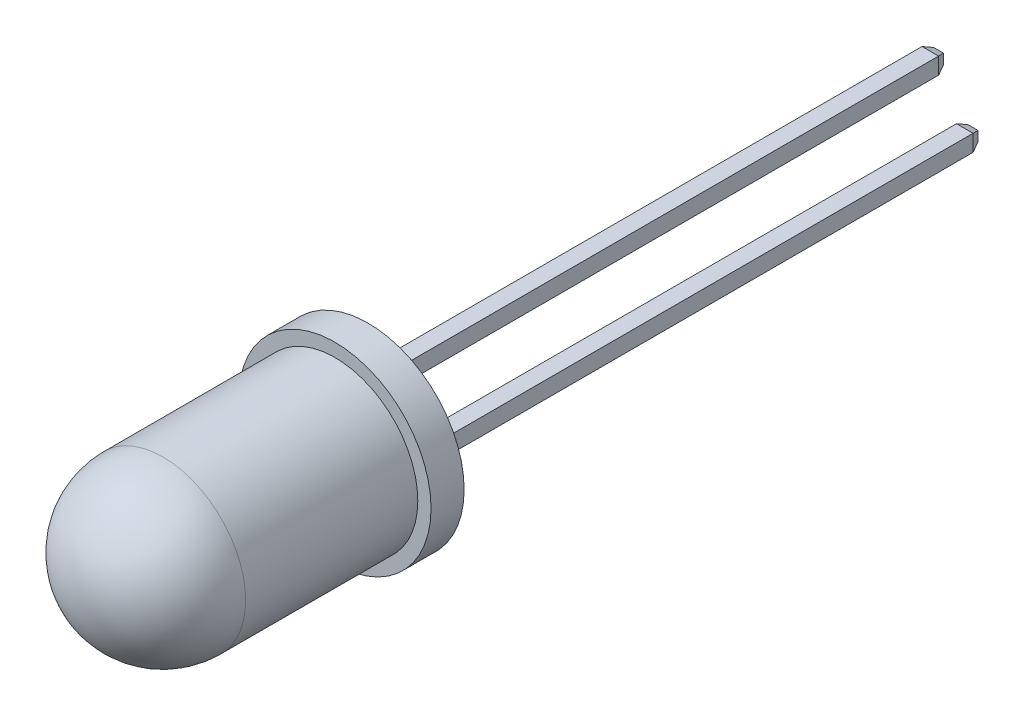
ISO-10303-21;
HEADER;
FILE_DESCRIPTION(('STEP AP214'),'2;1');
FILE_NAME('part.step','',(''),(''),'','','');
FILE_SCHEMA(('AUTOMOTIVE_DESIGN { 1 0 10303 214 1 1 1 1 }'));
ENDSEC;
DATA;
#1=APPLICATION_CONTEXT('core data for automotive mechanical design processes');
#2=APPLICATION_PROTOCOL_DEFINITION('international standard','automotive_design',2000,#1);
#3=PRODUCT_CONTEXT('',#1,'mechanical');
#4=PRODUCT('Part','Part','',(#3));
#5=PRODUCT_RELATED_PRODUCT_CATEGORY('part','',(#4));
#6=PRODUCT_DEFINITION_FORMATION('','',#4);
#7=PRODUCT_DEFINITION_CONTEXT('part definition',#1,'design');
#8=PRODUCT_DEFINITION('design','',#6,#7);
#9=PRODUCT_DEFINITION_SHAPE('','',#8);
#10=(LENGTH_UNIT() NAMED_UNIT(*) SI_UNIT(.MILLI.,.METRE.));
#11=(NAMED_UNIT(*) PLANE_ANGLE_UNIT() SI_UNIT($,.RADIAN.));
#12=(NAMED_UNIT(*) SI_UNIT($,.STERADIAN.) SOLID_ANGLE_UNIT());
#13=UNCERTAINTY_MEASURE_WITH_UNIT(LENGTH_MEASURE(1.E-05),#10,'distance_accuracy_value','');
#14=(GEOMETRIC_REPRESENTATION_CONTEXT(3) GLOBAL_UNCERTAINTY_ASSIGNED_CONTEXT((#13)) GLOBAL_UNIT_ASSIGNED_CONTEXT((#10,
#11,#12)) REPRESENTATION_CONTEXT('',''));
#15=CARTESIAN_POINT('',(0.,0.,0.));
#16=DIRECTION('',(0.,0.,1.));
#17=DIRECTION('',(1.,0.,0.));
#18=AXIS2_PLACEMENT_3D('',#15,#16,#17);
#19=CARTESIAN_POINT('',(0.,0.,0.));
#20=DIRECTION('',(0.,0.,1.));
#21=DIRECTION('',(1.,0.,0.));
#22=AXIS2_PLACEMENT_3D('',#19,#20,#21);
#23=SPHERICAL_SURFACE('',#22,2.5);
#24=CARTESIAN_POINT('',(0.,0.,0.));
#25=DIRECTION('',(0.,0.,-1.));
#26=DIRECTION('',(1.,0.,0.));
#27=AXIS2_PLACEMENT_3D('',#24,#25,#26);
#28=CIRCLE('',#27,2.5);
#29=CARTESIAN_POINT('',(-2.5,0.,0.));
#30=VERTEX_POINT('',#29);
#31=CARTESIAN_POINT('',(2.5,0.,0.));
#32=VERTEX_POINT('',#31);
#33=EDGE_CURVE('P0_E27',#30,#32,#28,.T.);
#34=ORIENTED_EDGE('',*,*,#33,.F.);
#35=CARTESIAN_POINT('',(0.,0.,0.));
#36=DIRECTION('',(0.,-1.,0.));
#37=DIRECTION('',(-1.,0.,0.));
#38=AXIS2_PLACEMENT_3D('',#35,#36,#37);
#39=CIRCLE('',#38,2.5);
#40=CARTESIAN_POINT('',(0.,0.,2.5));
#41=VERTEX_POINT('',#40);
#42=EDGE_CURVE('P0_E11',#41,#30,#39,.T.);
#43=ORIENTED_EDGE('',*,*,#42,.F.);
#44=ORIENTED_EDGE('',*,*,#42,.T.);
#45=CARTESIAN_POINT('',(0.,0.,0.));
#46=DIRECTION('',(0.,0.,-1.));
#47=DIRECTION('',(1.,0.,0.));
#48=AXIS2_PLACEMENT_3D('',#45,#46,#47);
#49=CIRCLE('',#48,2.5);
#50=EDGE_CURVE('P0_E71',#32,#30,#49,.T.);
#51=ORIENTED_EDGE('',*,*,#50,.F.);
#52=EDGE_LOOP('',(#34,#43,#44,#51));
#53=FACE_BOUND('',#52,.T.);
#54=ADVANCED_FACE('P0_F17',(#53),#23,.T.);
#55=CARTESIAN_POINT('',(0.,0.,-2.6));
#56=DIRECTION('',(0.,0.,-1.));
#57=DIRECTION('',(-1.,0.,0.));
#58=AXIS2_PLACEMENT_3D('',#55,#56,#57);
#59=CYLINDRICAL_SURFACE('',#58,2.5);
#60=CARTESIAN_POINT('',(0.,0.,-5.2));
#61=DIRECTION('',(0.,0.,-1.));
#62=DIRECTION('',(1.,0.,0.));
#63=AXIS2_PLACEMENT_3D('',#60,#61,#62);
#64=CIRCLE('',#63,2.5);
#65=CARTESIAN_POINT('',(2.5,0.,-5.2));
#66=VERTEX_POINT('',#65);
#67=EDGE_CURVE('P0_E68',#66,#66,#64,.T.);
#68=ORIENTED_EDGE('',*,*,#67,.F.);
#69=DIRECTION('',(0.,0.,1.));
#70=VECTOR('',#69,1.);
#71=CARTESIAN_POINT('',(2.5,0.,-2.6));
#72=LINE('',#71,#70);
#73=EDGE_CURVE('P0_E65',#66,#32,#72,.T.);
#74=ORIENTED_EDGE('',*,*,#73,.T.);
#75=ORIENTED_EDGE('',*,*,#50,.T.);
#76=ORIENTED_EDGE('',*,*,#33,.T.);
#77=ORIENTED_EDGE('',*,*,#73,.F.);
#78=EDGE_LOOP('',(#68,#74,#75,#76,#77));
#79=FACE_BOUND('',#78,.T.);
#80=ADVANCED_FACE('P0_F67',(#79),#59,.T.);
#81=CARTESIAN_POINT('',(-2.9,0.,-5.2));
#82=DIRECTION('',(0.,0.,1.));
#83=DIRECTION('',(1.,0.,0.));
#84=AXIS2_PLACEMENT_3D('',#81,#82,#83);
#85=PLANE('',#84);
#86=ORIENTED_EDGE('',*,*,#67,.T.);
#87=EDGE_LOOP('',(#86));
#88=FACE_BOUND('',#87,.T.);
#89=CARTESIAN_POINT('',(0.,0.,-5.2));
#90=DIRECTION('',(0.,0.,-1.));
#91=DIRECTION('',(1.,0.,0.));
#92=AXIS2_PLACEMENT_3D('',#89,#90,#91);
#93=CIRCLE('',#92,2.9);
#94=CARTESIAN_POINT('',(2.9,0.,-5.2));
#95=VERTEX_POINT('',#94);
#96=EDGE_CURVE('P0_E21',#95,#95,#93,.T.);
#97=ORIENTED_EDGE('',*,*,#96,.F.);
#98=EDGE_LOOP('',(#97));
#99=FACE_BOUND('',#98,.T.);
#100=ADVANCED_FACE('P0_F19',(#88,#99),#85,.T.);
#101=CARTESIAN_POINT('',(0.,0.,-5.7));
#102=DIRECTION('',(0.,0.,-1.));
#103=DIRECTION('',(-1.,0.,0.));
#104=AXIS2_PLACEMENT_3D('',#101,#102,#103);
#105=CYLINDRICAL_SURFACE('',#104,2.9);
#106=CARTESIAN_POINT('',(0.,0.,-6.2));
#107=DIRECTION('',(0.,0.,-1.));
#108=DIRECTION('',(1.,0.,0.));
#109=AXIS2_PLACEMENT_3D('',#106,#107,#108);
#110=CIRCLE('',#109,2.9);
#111=CARTESIAN_POINT('',(2.9,0.,-6.2));
#112=VERTEX_POINT('',#111);
#113=EDGE_CURVE('P0_E87',#112,#112,#110,.T.);
#114=ORIENTED_EDGE('',*,*,#113,.F.);
#115=DIRECTION('',(0.,0.,1.));
#116=VECTOR('',#115,1.);
#117=CARTESIAN_POINT('',(2.9,0.,-5.7));
#118=LINE('',#117,#116);
#119=EDGE_CURVE('P0_E80',#112,#95,#118,.T.);
#120=ORIENTED_EDGE('',*,*,#119,.T.);
#121=ORIENTED_EDGE('',*,*,#96,.T.);
#122=ORIENTED_EDGE('',*,*,#119,.F.);
#123=EDGE_LOOP('',(#114,#120,#121,#122));
#124=FACE_BOUND('',#123,.T.);
#125=ADVANCED_FACE('P0_F94',(#124),#105,.T.);
#126=CARTESIAN_POINT('',(0.,0.,-6.2));
#127=DIRECTION('',(0.,0.,-1.));
#128=DIRECTION('',(0.,-1.,0.));
#129=AXIS2_PLACEMENT_3D('',#126,#127,#128);
#130=PLANE('',#129);
#131=ORIENTED_EDGE('',*,*,#113,.T.);
#132=EDGE_LOOP('',(#131));
#133=FACE_BOUND('',#132,.T.);
#134=ADVANCED_FACE('P0_F93',(#133),#130,.T.);
#135=CLOSED_SHELL('',(#54,#80,#100,#125,#134));
#136=MANIFOLD_SOLID_BREP('P0_B1',#135);
#137=CARTESIAN_POINT('',(-1.02,-0.249999953433879,-6.2));
#138=DIRECTION('',(0.,-1.,0.));
#139=DIRECTION('',(0.,0.,-1.));
#140=AXIS2_PLACEMENT_3D('',#137,#138,#139);
#141=PLANE('',#140);
#142=DIRECTION('',(-1.,0.,0.));
#143=VECTOR('',#142,1.);
#144=CARTESIAN_POINT('',(-1.145,-0.249999953433879,-24.45));
#145=LINE('',#144,#143);
#146=CARTESIAN_POINT('',(-1.02,-0.249999953433879,-24.45));
#147=VERTEX_POINT('',#146);
#148=CARTESIAN_POINT('',(-1.52,-0.249999953433879,-24.45));
#149=VERTEX_POINT('',#148);
#150=EDGE_CURVE('P1_E246',#147,#149,#145,.T.);
#151=ORIENTED_EDGE('',*,*,#150,.F.);
#152=DIRECTION('',(0.,0.,-1.));
#153=VECTOR('',#152,1.);
#154=CARTESIAN_POINT('',(-1.02,-0.249999953433879,-6.2));
#155=LINE('',#154,#153);
#156=CARTESIAN_POINT('',(-1.02,-0.249999953433879,-6.2));
#157=VERTEX_POINT('',#156);
#158=EDGE_CURVE('P1_E41',#157,#147,#155,.T.);
#159=ORIENTED_EDGE('',*,*,#158,.F.);
#160=DIRECTION('',(0.00909052693064519,0.,0.999958680306403));
#161=VECTOR('',#160,1.);
#162=CARTESIAN_POINT('',(-1.00000001490116,-0.25,-4.00000005960464));
#163=LINE('',#162,#161);
#164=CARTESIAN_POINT('',(-1.00000001490116,-0.25,-4.00000005960464));
#165=VERTEX_POINT('',#164);
#166=EDGE_CURVE('P1_E151',#157,#165,#163,.T.);
#167=ORIENTED_EDGE('',*,*,#166,.T.);
#168=DIRECTION('',(1.,0.,0.));
#169=VECTOR('',#168,1.);
#170=CARTESIAN_POINT('',(-0.279064603238777,-0.25,-4.00000005960464));
#171=LINE('',#170,#169);
#172=CARTESIAN_POINT('',(-0.279064603238777,-0.25,-4.00000005960464));
#173=VERTEX_POINT('',#172);
#174=EDGE_CURVE('P1_E168',#165,#173,#171,.T.);
#175=ORIENTED_EDGE('',*,*,#174,.T.);
#176=DIRECTION('',(-0.523156160420928,0.,0.852236840211471));
#177=VECTOR('',#176,1.);
#178=CARTESIAN_POINT('',(-0.999999977648259,-0.25,-2.82557503708544));
#179=LINE('',#178,#177);
#180=CARTESIAN_POINT('',(-0.999999977648259,-0.25,-2.82557503708544));
#181=VERTEX_POINT('',#180);
#182=EDGE_CURVE('P1_E294',#173,#181,#179,.T.);
#183=ORIENTED_EDGE('',*,*,#182,.T.);
#184=DIRECTION('',(0.,0.,1.));
#185=VECTOR('',#184,1.);
#186=CARTESIAN_POINT('',(-0.999999977648258,-0.25,-2.35925807482562));
#187=LINE('',#186,#185);
#188=CARTESIAN_POINT('',(-0.999999977648258,-0.25,-2.35925807482562));
#189=VERTEX_POINT('',#188);
#190=EDGE_CURVE('P1_E179',#181,#189,#187,.T.);
#191=ORIENTED_EDGE('',*,*,#190,.T.);
#192=DIRECTION('',(-1.,0.,0.));
#193=VECTOR('',#192,1.);
#194=CARTESIAN_POINT('',(-1.76000001490117,-0.25,-2.35925807482562));
#195=LINE('',#194,#193);
#196=CARTESIAN_POINT('',(-1.76000001490117,-0.25,-2.35925807482562));
#197=VERTEX_POINT('',#196);
#198=EDGE_CURVE('P1_E200',#189,#197,#195,.T.);
#199=ORIENTED_EDGE('',*,*,#198,.T.);
#200=DIRECTION('',(0.,0.,-1.));
#201=VECTOR('',#200,1.);
#202=CARTESIAN_POINT('',(-1.76000001490116,-0.25,-4.00000005960465));
#203=LINE('',#202,#201);
#204=CARTESIAN_POINT('',(-1.76000001490116,-0.25,-4.00000005960465));
#205=VERTEX_POINT('',#204);
#206=EDGE_CURVE('P1_E208',#197,#205,#203,.T.);
#207=ORIENTED_EDGE('',*,*,#206,.T.);
#208=DIRECTION('',(-1.,0.,0.));
#209=VECTOR('',#208,1.);
#210=CARTESIAN_POINT('',(-2.00000002980232,-0.25,-4.00000005960464));
#211=LINE('',#210,#209);
#212=CARTESIAN_POINT('',(-2.00000002980232,-0.25,-4.00000005960464));
#213=VERTEX_POINT('',#212);
#214=EDGE_CURVE('P1_E257',#205,#213,#211,.T.);
#215=ORIENTED_EDGE('',*,*,#214,.T.);
#216=DIRECTION('',(0.,0.,-1.));
#217=VECTOR('',#216,1.);
#218=CARTESIAN_POINT('',(-2.00000002980232,-0.25,-5.00000007450581));
#219=LINE('',#218,#217);
#220=CARTESIAN_POINT('',(-2.00000002980232,-0.25,-5.00000007450581));
#221=VERTEX_POINT('',#220);
#222=EDGE_CURVE('P1_E225',#213,#221,#219,.T.);
#223=ORIENTED_EDGE('',*,*,#222,.T.);
#224=DIRECTION('',(1.,0.,0.));
#225=VECTOR('',#224,1.);
#226=CARTESIAN_POINT('',(-1.52,-0.25,-5.00000007450581));
#227=LINE('',#226,#225);
#228=CARTESIAN_POINT('',(-1.52,-0.25,-5.00000007450581));
#229=VERTEX_POINT('',#228);
#230=EDGE_CURVE('P1_E189',#221,#229,#227,.T.);
#231=ORIENTED_EDGE('',*,*,#230,.T.);
#232=DIRECTION('',(0.,0.,-1.));
#233=VECTOR('',#232,1.);
#234=CARTESIAN_POINT('',(-1.52,-0.25,-6.2));
#235=LINE('',#234,#233);
#236=EDGE_CURVE('P1_E11',#229,#149,#235,.T.);
#237=ORIENTED_EDGE('',*,*,#236,.T.);
#238=EDGE_LOOP('',(#151,#159,#167,#175,#183,#191,#199,#207,#215,#223,#231,#237));
#239=FACE_BOUND('',#238,.T.);
#240=ADVANCED_FACE('P1_F17',(#239),#141,.T.);
#241=CARTESIAN_POINT('',(-1.52,-0.249999953433879,-6.2));
#242=DIRECTION('',(-1.,0.,0.));
#243=DIRECTION('',(0.,0.,1.));
#244=AXIS2_PLACEMENT_3D('',#241,#242,#243);
#245=PLANE('',#244);
#246=DIRECTION('',(0.,1.,0.));
#247=VECTOR('',#246,1.);
#248=CARTESIAN_POINT('',(-1.52,-0.124999976716939,-24.45));
#249=LINE('',#248,#247);
#250=CARTESIAN_POINT('',(-1.52,0.249999953433879,-24.45));
#251=VERTEX_POINT('',#250);
#252=EDGE_CURVE('P1_E194',#149,#251,#249,.T.);
#253=ORIENTED_EDGE('',*,*,#252,.F.);
#254=ORIENTED_EDGE('',*,*,#236,.F.);
#255=DIRECTION('',(0.,1.,0.));
#256=VECTOR('',#255,1.);
#257=CARTESIAN_POINT('',(-1.52,0.,-5.00000007450581));
#258=LINE('',#257,#256);
#259=CARTESIAN_POINT('',(-1.52,0.25,-5.00000007450581));
#260=VERTEX_POINT('',#259);
#261=EDGE_CURVE('P1_E185',#229,#260,#258,.T.);
#262=ORIENTED_EDGE('',*,*,#261,.T.);
#263=DIRECTION('',(0.,0.,1.));
#264=VECTOR('',#263,1.);
#265=CARTESIAN_POINT('',(-1.52,0.25,-6.2));
#266=LINE('',#265,#264);
#267=EDGE_CURVE('P1_E28',#251,#260,#266,.T.);
#268=ORIENTED_EDGE('',*,*,#267,.F.);
#269=EDGE_LOOP('',(#253,#254,#262,#268));
#270=FACE_BOUND('',#269,.T.);
#271=ADVANCED_FACE('P1_F441',(#270),#245,.T.);
#272=CARTESIAN_POINT('',(-1.27,0.,-24.7));
#273=DIRECTION('',(0.,0.,-1.));
#274=DIRECTION('',(0.,-1.,0.));
#275=AXIS2_PLACEMENT_3D('',#272,#273,#274);
#276=PLANE('',#275);
#277=DIRECTION('',(-1.,0.,0.));
#278=VECTOR('',#277,1.);
#279=CARTESIAN_POINT('',(-1.395,0.149999953433879,-24.7));
#280=LINE('',#279,#278);
#281=CARTESIAN_POINT('',(-1.12,0.149999953433879,-24.7));
#282=VERTEX_POINT('',#281);
#283=CARTESIAN_POINT('',(-1.42,0.149999953433879,-24.7));
#284=VERTEX_POINT('',#283);
#285=EDGE_CURVE('P1_E193',#282,#284,#280,.T.);
#286=ORIENTED_EDGE('',*,*,#285,.F.);
#287=DIRECTION('',(0.,1.,0.));
#288=VECTOR('',#287,1.);
#289=CARTESIAN_POINT('',(-1.12,0.124999976716939,-24.7));
#290=LINE('',#289,#288);
#291=CARTESIAN_POINT('',(-1.12,-0.149999953433879,-24.7));
#292=VERTEX_POINT('',#291);
#293=EDGE_CURVE('P1_E218',#292,#282,#290,.T.);
#294=ORIENTED_EDGE('',*,*,#293,.F.);
#295=DIRECTION('',(1.,0.,0.));
#296=VECTOR('',#295,1.);
#297=CARTESIAN_POINT('',(-1.145,-0.149999953433879,-24.7));
#298=LINE('',#297,#296);
#299=CARTESIAN_POINT('',(-1.42,-0.149999953433879,-24.7));
#300=VERTEX_POINT('',#299);
#301=EDGE_CURVE('P1_E198',#300,#292,#298,.T.);
#302=ORIENTED_EDGE('',*,*,#301,.F.);
#303=DIRECTION('',(0.,-1.,0.));
#304=VECTOR('',#303,1.);
#305=CARTESIAN_POINT('',(-1.42,-0.124999976716939,-24.7));
#306=LINE('',#305,#304);
#307=EDGE_CURVE('P1_E236',#284,#300,#306,.T.);
#308=ORIENTED_EDGE('',*,*,#307,.F.);
#309=EDGE_LOOP('',(#286,#294,#302,#308));
#310=FACE_BOUND('',#309,.T.);
#311=ADVANCED_FACE('P1_F274',(#310),#276,.T.);
#312=CARTESIAN_POINT('',(-1.52,0.249999953433879,-6.2));
#313=DIRECTION('',(0.,1.,0.));
#314=DIRECTION('',(1.,0.,0.));
#315=AXIS2_PLACEMENT_3D('',#312,#313,#314);
#316=PLANE('',#315);
#317=DIRECTION('',(1.,0.,0.));
#318=VECTOR('',#317,1.);
#319=CARTESIAN_POINT('',(-1.395,0.249999953433879,-24.45));
#320=LINE('',#319,#318);
#321=CARTESIAN_POINT('',(-1.02,0.249999953433879,-24.45));
#322=VERTEX_POINT('',#321);
#323=EDGE_CURVE('P1_E245',#251,#322,#320,.T.);
#324=ORIENTED_EDGE('',*,*,#323,.F.);
#325=ORIENTED_EDGE('',*,*,#267,.T.);
#326=DIRECTION('',(-1.,0.,0.));
#327=VECTOR('',#326,1.);
#328=CARTESIAN_POINT('',(-1.52,0.25,-5.00000007450581));
#329=LINE('',#328,#327);
#330=CARTESIAN_POINT('',(-2.00000002980232,0.25,-5.00000007450581));
#331=VERTEX_POINT('',#330);
#332=EDGE_CURVE('P1_E190',#260,#331,#329,.T.);
#333=ORIENTED_EDGE('',*,*,#332,.T.);
#334=DIRECTION('',(0.,0.,1.));
#335=VECTOR('',#334,1.);
#336=CARTESIAN_POINT('',(-2.00000002980232,0.25,-5.00000007450581));
#337=LINE('',#336,#335);
#338=CARTESIAN_POINT('',(-2.00000002980232,0.25,-4.00000005960464));
#339=VERTEX_POINT('',#338);
#340=EDGE_CURVE('P1_E226',#331,#339,#337,.T.);
#341=ORIENTED_EDGE('',*,*,#340,.T.);
#342=DIRECTION('',(1.,0.,0.));
#343=VECTOR('',#342,1.);
#344=CARTESIAN_POINT('',(-2.00000002980232,0.25,-4.00000005960464));
#345=LINE('',#344,#343);
#346=CARTESIAN_POINT('',(-1.76000001490116,0.25,-4.00000005960465));
#347=VERTEX_POINT('',#346);
#348=EDGE_CURVE('P1_E21',#339,#347,#345,.T.);
#349=ORIENTED_EDGE('',*,*,#348,.T.);
#350=DIRECTION('',(0.,0.,1.));
#351=VECTOR('',#350,1.);
#352=CARTESIAN_POINT('',(-1.76000001490116,0.25,-4.00000005960465));
#353=LINE('',#352,#351);
#354=CARTESIAN_POINT('',(-1.76000001490117,0.25,-2.35925807482562));
#355=VERTEX_POINT('',#354);
#356=EDGE_CURVE('P1_E204',#347,#355,#353,.T.);
#357=ORIENTED_EDGE('',*,*,#356,.T.);
#358=DIRECTION('',(1.,0.,0.));
#359=VECTOR('',#358,1.);
#360=CARTESIAN_POINT('',(-1.76000001490117,0.25,-2.35925807482562));
#361=LINE('',#360,#359);
#362=CARTESIAN_POINT('',(-0.999999977648258,0.25,-2.35925807482562));
#363=VERTEX_POINT('',#362);
#364=EDGE_CURVE('P1_E183',#355,#363,#361,.T.);
#365=ORIENTED_EDGE('',*,*,#364,.T.);
#366=DIRECTION('',(0.,0.,-1.));
#367=VECTOR('',#366,1.);
#368=CARTESIAN_POINT('',(-0.999999977648258,0.25,-2.35925807482562));
#369=LINE('',#368,#367);
#370=CARTESIAN_POINT('',(-0.999999977648259,0.25,-2.82557503708544));
#371=VERTEX_POINT('',#370);
#372=EDGE_CURVE('P1_E298',#363,#371,#369,.T.);
#373=ORIENTED_EDGE('',*,*,#372,.T.);
#374=DIRECTION('',(0.523156160420928,0.,-0.852236840211471));
#375=VECTOR('',#374,1.);
#376=CARTESIAN_POINT('',(-0.999999977648259,0.25,-2.82557503708544));
#377=LINE('',#376,#375);
#378=CARTESIAN_POINT('',(-0.279064603238777,0.25,-4.00000005960464));
#379=VERTEX_POINT('',#378);
#380=EDGE_CURVE('P1_E158',#371,#379,#377,.T.);
#381=ORIENTED_EDGE('',*,*,#380,.T.);
#382=DIRECTION('',(-1.,0.,0.));
#383=VECTOR('',#382,1.);
#384=CARTESIAN_POINT('',(-0.279064603238777,0.25,-4.00000005960464));
#385=LINE('',#384,#383);
#386=CARTESIAN_POINT('',(-1.00000001490116,0.25,-4.00000005960464));
#387=VERTEX_POINT('',#386);
#388=EDGE_CURVE('P1_E154',#379,#387,#385,.T.);
#389=ORIENTED_EDGE('',*,*,#388,.T.);
#390=DIRECTION('',(-0.00909052693064519,0.,-0.999958680306403));
#391=VECTOR('',#390,1.);
#392=CARTESIAN_POINT('',(-1.00000001490116,0.25,-4.00000005960464));
#393=LINE('',#392,#391);
#394=CARTESIAN_POINT('',(-1.02,0.249999953433879,-6.2));
#395=VERTEX_POINT('',#394);
#396=EDGE_CURVE('P1_E142',#387,#395,#393,.T.);
#397=ORIENTED_EDGE('',*,*,#396,.T.);
#398=DIRECTION('',(0.,0.,-1.));
#399=VECTOR('',#398,1.);
#400=CARTESIAN_POINT('',(-1.02,0.249999953433879,-6.2));
#401=LINE('',#400,#399);
#402=EDGE_CURVE('P1_E215',#395,#322,#401,.T.);
#403=ORIENTED_EDGE('',*,*,#402,.T.);
#404=EDGE_LOOP('',(#324,#325,#333,#341,#349,#357,#365,#373,#381,#389,#397,#403));
#405=FACE_BOUND('',#404,.T.);
#406=ADVANCED_FACE('P1_F156',(#405),#316,.T.);
#407=CARTESIAN_POINT('',(-1.02,0.249999953433879,-6.2));
#408=DIRECTION('',(1.,0.,0.));
#409=DIRECTION('',(0.,1.,0.));
#410=AXIS2_PLACEMENT_3D('',#407,#408,#409);
#411=PLANE('',#410);
#412=DIRECTION('',(0.,-1.,0.));
#413=VECTOR('',#412,1.);
#414=CARTESIAN_POINT('',(-1.02,0.124999976716939,-24.45));
#415=LINE('',#414,#413);
#416=EDGE_CURVE('P1_E250',#322,#147,#415,.T.);
#417=ORIENTED_EDGE('',*,*,#416,.F.);
#418=ORIENTED_EDGE('',*,*,#402,.F.);
#419=DIRECTION('',(0.,1.,0.));
#420=VECTOR('',#419,1.);
#421=CARTESIAN_POINT('',(-1.02,0.124999976716939,-6.2));
#422=LINE('',#421,#420);
#423=EDGE_CURVE('P1_E148',#157,#395,#422,.T.);
#424=ORIENTED_EDGE('',*,*,#423,.F.);
#425=ORIENTED_EDGE('',*,*,#158,.T.);
#426=EDGE_LOOP('',(#417,#418,#424,#425));
#427=FACE_BOUND('',#426,.T.);
#428=ADVANCED_FACE('P1_F426',(#427),#411,.T.);
#429=CARTESIAN_POINT('',(-1.07,0.124999976716939,-24.575));
#430=DIRECTION('',(0.928476690885259,0.,-0.371390676354105));
#431=DIRECTION('',(0.,-1.,0.));
#432=AXIS2_PLACEMENT_3D('',#429,#430,#431);
#433=PLANE('',#432);
#434=ORIENTED_EDGE('',*,*,#416,.T.);
#435=DIRECTION('',(0.348155311911396,-0.348155311911397,0.870388279778489));
#436=VECTOR('',#435,1.);
#437=CARTESIAN_POINT('',(-1.12,-0.149999953433879,-24.7));
#438=LINE('',#437,#436);
#439=EDGE_CURVE('P1_E232',#292,#147,#438,.T.);
#440=ORIENTED_EDGE('',*,*,#439,.F.);
#441=ORIENTED_EDGE('',*,*,#293,.T.);
#442=DIRECTION('',(0.348155311911396,0.348155311911397,0.870388279778488));
#443=VECTOR('',#442,1.);
#444=CARTESIAN_POINT('',(-1.12,0.149999953433879,-24.7));
#445=LINE('',#444,#443);
#446=EDGE_CURVE('P1_E240',#282,#322,#445,.T.);
#447=ORIENTED_EDGE('',*,*,#446,.T.);
#448=EDGE_LOOP('',(#434,#440,#441,#447));
#449=FACE_BOUND('',#448,.T.);
#450=ADVANCED_FACE('P1_F264',(#449),#433,.T.);
#451=CARTESIAN_POINT('',(-1.145,-0.199999953433879,-24.575));
#452=DIRECTION('',(0.,-0.928476690885259,-0.371390676354105));
#453=DIRECTION('',(0.,0.371390676354105,-0.928476690885259));
#454=AXIS2_PLACEMENT_3D('',#451,#452,#453);
#455=PLANE('',#454);
#456=ORIENTED_EDGE('',*,*,#301,.T.);
#457=ORIENTED_EDGE('',*,*,#439,.T.);
#458=ORIENTED_EDGE('',*,*,#150,.T.);
#459=DIRECTION('',(-0.348155311911397,-0.348155311911397,0.870388279778488));
#460=VECTOR('',#459,1.);
#461=CARTESIAN_POINT('',(-1.42,-0.149999953433879,-24.7));
#462=LINE('',#461,#460);
#463=EDGE_CURVE('P1_E199',#300,#149,#462,.T.);
#464=ORIENTED_EDGE('',*,*,#463,.F.);
#465=EDGE_LOOP('',(#456,#457,#458,#464));
#466=FACE_BOUND('',#465,.T.);
#467=ADVANCED_FACE('P1_F425',(#466),#455,.T.);
#468=CARTESIAN_POINT('',(-1.47,-0.124999976716939,-24.575));
#469=DIRECTION('',(-0.928476690885259,0.,-0.371390676354105));
#470=DIRECTION('',(-0.371390676354105,0.,0.928476690885259));
#471=AXIS2_PLACEMENT_3D('',#468,#469,#470);
#472=PLANE('',#471);
#473=ORIENTED_EDGE('',*,*,#307,.T.);
#474=ORIENTED_EDGE('',*,*,#463,.T.);
#475=ORIENTED_EDGE('',*,*,#252,.T.);
#476=DIRECTION('',(-0.348155311911397,0.348155311911396,0.870388279778488));
#477=VECTOR('',#476,1.);
#478=CARTESIAN_POINT('',(-1.42,0.149999953433879,-24.7));
#479=LINE('',#478,#477);
#480=EDGE_CURVE('P1_E241',#284,#251,#479,.T.);
#481=ORIENTED_EDGE('',*,*,#480,.F.);
#482=EDGE_LOOP('',(#473,#474,#475,#481));
#483=FACE_BOUND('',#482,.T.);
#484=ADVANCED_FACE('P1_F19',(#483),#472,.T.);
#485=CARTESIAN_POINT('',(-1.395,0.199999953433879,-24.575));
#486=DIRECTION('',(0.,0.928476690885259,-0.371390676354105));
#487=DIRECTION('',(-1.,0.,0.));
#488=AXIS2_PLACEMENT_3D('',#485,#486,#487);
#489=PLANE('',#488);
#490=ORIENTED_EDGE('',*,*,#285,.T.);
#491=ORIENTED_EDGE('',*,*,#480,.T.);
#492=ORIENTED_EDGE('',*,*,#323,.T.);
#493=ORIENTED_EDGE('',*,*,#446,.F.);
#494=EDGE_LOOP('',(#490,#491,#492,#493));
#495=FACE_BOUND('',#494,.T.);
#496=ADVANCED_FACE('P1_F271',(#495),#489,.T.);
#497=CARTESIAN_POINT('',(-1.00000001490116,0.,-4.00000005960464));
#498=DIRECTION('',(0.999958680306403,0.,-0.00909052693064519));
#499=DIRECTION('',(0.,-1.,0.));
#500=AXIS2_PLACEMENT_3D('',#497,#498,#499);
#501=PLANE('',#500);
#502=ORIENTED_EDGE('',*,*,#423,.T.);
#503=ORIENTED_EDGE('',*,*,#396,.F.);
#504=DIRECTION('',(0.,-1.,0.));
#505=VECTOR('',#504,1.);
#506=CARTESIAN_POINT('',(-1.00000001490116,0.,-4.00000005960464));
#507=LINE('',#506,#505);
#508=EDGE_CURVE('P1_E147',#387,#165,#507,.T.);
#509=ORIENTED_EDGE('',*,*,#508,.T.);
#510=ORIENTED_EDGE('',*,*,#166,.F.);
#511=EDGE_LOOP('',(#502,#503,#509,#510));
#512=FACE_BOUND('',#511,.T.);
#513=ADVANCED_FACE('P1_F144',(#512),#501,.T.);
#514=CARTESIAN_POINT('',(-1.52,0.,-5.00000007450581));
#515=DIRECTION('',(0.,0.,-1.));
#516=DIRECTION('',(0.,-1.,0.));
#517=AXIS2_PLACEMENT_3D('',#514,#515,#516);
#518=PLANE('',#517);
#519=DIRECTION('',(0.,1.,0.));
#520=VECTOR('',#519,1.);
#521=CARTESIAN_POINT('',(-2.00000002980232,0.,-5.00000007450581));
#522=LINE('',#521,#520);
#523=EDGE_CURVE('P1_E221',#221,#331,#522,.T.);
#524=ORIENTED_EDGE('',*,*,#523,.T.);
#525=ORIENTED_EDGE('',*,*,#332,.F.);
#526=ORIENTED_EDGE('',*,*,#261,.F.);
#527=ORIENTED_EDGE('',*,*,#230,.F.);
#528=EDGE_LOOP('',(#524,#525,#526,#527));
#529=FACE_BOUND('',#528,.T.);
#530=ADVANCED_FACE('P1_F340',(#529),#518,.T.);
#531=CARTESIAN_POINT('',(-2.00000002980232,0.,-5.00000007450581));
#532=DIRECTION('',(-1.,0.,0.));
#533=DIRECTION('',(0.,1.,0.));
#534=AXIS2_PLACEMENT_3D('',#531,#532,#533);
#535=PLANE('',#534);
#536=DIRECTION('',(0.,1.,0.));
#537=VECTOR('',#536,1.);
#538=CARTESIAN_POINT('',(-2.00000002980232,0.,-4.00000005960464));
#539=LINE('',#538,#537);
#540=EDGE_CURVE('P1_E253',#213,#339,#539,.T.);
#541=ORIENTED_EDGE('',*,*,#540,.T.);
#542=ORIENTED_EDGE('',*,*,#340,.F.);
#543=ORIENTED_EDGE('',*,*,#523,.F.);
#544=ORIENTED_EDGE('',*,*,#222,.F.);
#545=EDGE_LOOP('',(#541,#542,#543,#544));
#546=FACE_BOUND('',#545,.T.);
#547=ADVANCED_FACE('P1_F325',(#546),#535,.T.);
#548=CARTESIAN_POINT('',(-2.00000002980232,0.,-4.00000005960464));
#549=DIRECTION('',(0.,0.,1.));
#550=DIRECTION('',(1.,0.,0.));
#551=AXIS2_PLACEMENT_3D('',#548,#549,#550);
#552=PLANE('',#551);
#553=DIRECTION('',(0.,1.,0.));
#554=VECTOR('',#553,1.);
#555=CARTESIAN_POINT('',(-1.76000001490116,0.,-4.00000005960465));
#556=LINE('',#555,#554);
#557=EDGE_CURVE('P1_E211',#205,#347,#556,.T.);
#558=ORIENTED_EDGE('',*,*,#557,.T.);
#559=ORIENTED_EDGE('',*,*,#348,.F.);
#560=ORIENTED_EDGE('',*,*,#540,.F.);
#561=ORIENTED_EDGE('',*,*,#214,.F.);
#562=EDGE_LOOP('',(#558,#559,#560,#561));
#563=FACE_BOUND('',#562,.T.);
#564=ADVANCED_FACE('P1_F327',(#563),#552,.T.);
#565=CARTESIAN_POINT('',(-1.76000001490116,0.,-4.00000005960465));
#566=DIRECTION('',(-1.,0.,0.));
#567=DIRECTION('',(0.,0.,1.));
#568=AXIS2_PLACEMENT_3D('',#565,#566,#567);
#569=PLANE('',#568);
#570=DIRECTION('',(0.,1.,0.));
#571=VECTOR('',#570,1.);
#572=CARTESIAN_POINT('',(-1.76000001490117,0.,-2.35925807482562));
#573=LINE('',#572,#571);
#574=EDGE_CURVE('P1_E205',#197,#355,#573,.T.);
#575=ORIENTED_EDGE('',*,*,#574,.T.);
#576=ORIENTED_EDGE('',*,*,#356,.F.);
#577=ORIENTED_EDGE('',*,*,#557,.F.);
#578=ORIENTED_EDGE('',*,*,#206,.F.);
#579=EDGE_LOOP('',(#575,#576,#577,#578));
#580=FACE_BOUND('',#579,.T.);
#581=ADVANCED_FACE('P1_F354',(#580),#569,.T.);
#582=CARTESIAN_POINT('',(-1.76000001490117,0.,-2.35925807482562));
#583=DIRECTION('',(0.,0.,1.));
#584=DIRECTION('',(1.,0.,0.));
#585=AXIS2_PLACEMENT_3D('',#582,#583,#584);
#586=PLANE('',#585);
#587=DIRECTION('',(0.,1.,0.));
#588=VECTOR('',#587,1.);
#589=CARTESIAN_POINT('',(-0.999999977648258,0.,-2.35925807482562));
#590=LINE('',#589,#588);
#591=EDGE_CURVE('P1_E184',#189,#363,#590,.T.);
#592=ORIENTED_EDGE('',*,*,#591,.T.);
#593=ORIENTED_EDGE('',*,*,#364,.F.);
#594=ORIENTED_EDGE('',*,*,#574,.F.);
#595=ORIENTED_EDGE('',*,*,#198,.F.);
#596=EDGE_LOOP('',(#592,#593,#594,#595));
#597=FACE_BOUND('',#596,.T.);
#598=ADVANCED_FACE('P1_F348',(#597),#586,.T.);
#599=CARTESIAN_POINT('',(-0.999999977648258,0.,-2.35925807482562));
#600=DIRECTION('',(1.,0.,0.));
#601=DIRECTION('',(0.,0.,-1.));
#602=AXIS2_PLACEMENT_3D('',#599,#600,#601);
#603=PLANE('',#602);
#604=DIRECTION('',(0.,1.,0.));
#605=VECTOR('',#604,1.);
#606=CARTESIAN_POINT('',(-0.999999977648259,0.,-2.82557503708544));
#607=LINE('',#606,#605);
#608=EDGE_CURVE('P1_E178',#181,#371,#607,.T.);
#609=ORIENTED_EDGE('',*,*,#608,.T.);
#610=ORIENTED_EDGE('',*,*,#372,.F.);
#611=ORIENTED_EDGE('',*,*,#591,.F.);
#612=ORIENTED_EDGE('',*,*,#190,.F.);
#613=EDGE_LOOP('',(#609,#610,#611,#612));
#614=FACE_BOUND('',#613,.T.);
#615=ADVANCED_FACE('P1_F353',(#614),#603,.T.);
#616=CARTESIAN_POINT('',(-0.999999977648259,0.,-2.82557503708544));
#617=DIRECTION('',(0.852236840211471,0.,0.523156160420928));
#618=DIRECTION('',(0.,-1.,0.));
#619=AXIS2_PLACEMENT_3D('',#616,#617,#618);
#620=PLANE('',#619);
#621=DIRECTION('',(0.,1.,0.));
#622=VECTOR('',#621,1.);
#623=CARTESIAN_POINT('',(-0.279064603238777,0.,-4.00000005960464));
#624=LINE('',#623,#622);
#625=EDGE_CURVE('P1_E163',#173,#379,#624,.T.);
#626=ORIENTED_EDGE('',*,*,#625,.T.);
#627=ORIENTED_EDGE('',*,*,#380,.F.);
#628=ORIENTED_EDGE('',*,*,#608,.F.);
#629=ORIENTED_EDGE('',*,*,#182,.F.);
#630=EDGE_LOOP('',(#626,#627,#628,#629));
#631=FACE_BOUND('',#630,.T.);
#632=ADVANCED_FACE('P1_F374',(#631),#620,.T.);
#633=CARTESIAN_POINT('',(-0.279064603238777,0.,-4.00000005960464));
#634=DIRECTION('',(0.,0.,-1.));
#635=DIRECTION('',(-1.,0.,0.));
#636=AXIS2_PLACEMENT_3D('',#633,#634,#635);
#637=PLANE('',#636);
#638=ORIENTED_EDGE('',*,*,#508,.F.);
#639=ORIENTED_EDGE('',*,*,#388,.F.);
#640=ORIENTED_EDGE('',*,*,#625,.F.);
#641=ORIENTED_EDGE('',*,*,#174,.F.);
#642=EDGE_LOOP('',(#638,#639,#640,#641));
#643=FACE_BOUND('',#642,.T.);
#644=ADVANCED_FACE('P1_F166',(#643),#637,.T.);
#645=CLOSED_SHELL('',(#240,#271,#311,#406,#428,#450,#467,#484,#496,#513,#530,#547,#564,#581,
#598,#615,#632,#644));
#646=MANIFOLD_SOLID_BREP('P1_B1',#645);
#647=CARTESIAN_POINT('',(1.02,0.249999953433879,-6.2));
#648=DIRECTION('',(0.,1.,0.));
#649=DIRECTION('',(1.,0.,0.));
#650=AXIS2_PLACEMENT_3D('',#647,#648,#649);
#651=PLANE('',#650);
#652=DIRECTION('',(1.,0.,0.));
#653=VECTOR('',#652,1.);
#654=CARTESIAN_POINT('',(1.145,0.249999953433879,-22.95));
#655=LINE('',#654,#653);
#656=CARTESIAN_POINT('',(1.02,0.249999953433879,-22.95));
#657=VERTEX_POINT('',#656);
#658=CARTESIAN_POINT('',(1.52,0.249999953433879,-22.95));
#659=VERTEX_POINT('',#658);
#660=EDGE_CURVE('P2_E184',#657,#659,#655,.T.);
#661=ORIENTED_EDGE('',*,*,#660,.F.);
#662=DIRECTION('',(0.,0.,-1.));
#663=VECTOR('',#662,1.);
#664=CARTESIAN_POINT('',(1.02,0.249999953433879,-6.2));
#665=LINE('',#664,#663);
#666=CARTESIAN_POINT('',(1.02,0.25,-4.00000005960464));
#667=VERTEX_POINT('',#666);
#668=EDGE_CURVE('P2_E42',#667,#657,#665,.T.);
#669=ORIENTED_EDGE('',*,*,#668,.F.);
#670=DIRECTION('',(-1.,0.,0.));
#671=VECTOR('',#670,1.);
#672=CARTESIAN_POINT('',(0.344751455826432,0.25,-4.00000005960464));
#673=LINE('',#672,#671);
#674=CARTESIAN_POINT('',(0.344751455826432,0.25,-4.00000005960464));
#675=VERTEX_POINT('',#674);
#676=EDGE_CURVE('P2_E138',#667,#675,#673,.T.);
#677=ORIENTED_EDGE('',*,*,#676,.T.);
#678=DIRECTION('',(-0.523156160420928,0.,0.852236840211471));
#679=VECTOR('',#678,1.);
#680=CARTESIAN_POINT('',(1.02,0.25,-5.09999988600612));
#681=LINE('',#680,#679);
#682=CARTESIAN_POINT('',(-0.399999991059304,0.25,-2.78677795145601));
#683=VERTEX_POINT('',#682);
#684=EDGE_CURVE('P2_E126',#675,#683,#681,.T.);
#685=ORIENTED_EDGE('',*,*,#684,.T.);
#686=DIRECTION('',(0.,0.,1.));
#687=VECTOR('',#686,1.);
#688=CARTESIAN_POINT('',(-0.399999991059304,0.25,-2.78677795145601));
#689=LINE('',#688,#687);
#690=CARTESIAN_POINT('',(-0.399999991059303,0.25,-2.35925807482562));
#691=VERTEX_POINT('',#690);
#692=EDGE_CURVE('P2_E154',#683,#691,#689,.T.);
#693=ORIENTED_EDGE('',*,*,#692,.T.);
#694=DIRECTION('',(1.,0.,0.));
#695=VECTOR('',#694,1.);
#696=CARTESIAN_POINT('',(-0.399999991059303,0.25,-2.35925807482562));
#697=LINE('',#696,#695);
#698=CARTESIAN_POINT('',(1.52,0.25,-2.35925807482562));
#699=VERTEX_POINT('',#698);
#700=EDGE_CURVE('P2_E149',#691,#699,#697,.T.);
#701=ORIENTED_EDGE('',*,*,#700,.T.);
#702=DIRECTION('',(0.,0.,-1.));
#703=VECTOR('',#702,1.);
#704=CARTESIAN_POINT('',(1.52,0.25,-2.35925807482562));
#705=LINE('',#704,#703);
#706=EDGE_CURVE('P2_E11',#699,#659,#705,.T.);
#707=ORIENTED_EDGE('',*,*,#706,.T.);
#708=EDGE_LOOP('',(#661,#669,#677,#685,#693,#701,#707));
#709=FACE_BOUND('',#708,.T.);
#710=ADVANCED_FACE('P2_F17',(#709),#651,.T.);
#711=CARTESIAN_POINT('',(1.52,0.249999953433879,-6.2));
#712=DIRECTION('',(1.,0.,0.));
#713=DIRECTION('',(0.,1.,0.));
#714=AXIS2_PLACEMENT_3D('',#711,#712,#713);
#715=PLANE('',#714);
#716=DIRECTION('',(0.,-1.,0.));
#717=VECTOR('',#716,1.);
#718=CARTESIAN_POINT('',(1.52,0.124999976716939,-22.95));
#719=LINE('',#718,#717);
#720=CARTESIAN_POINT('',(1.52,-0.249999953433879,-22.95));
#721=VERTEX_POINT('',#720);
#722=EDGE_CURVE('P2_E191',#659,#721,#719,.T.);
#723=ORIENTED_EDGE('',*,*,#722,.F.);
#724=ORIENTED_EDGE('',*,*,#706,.F.);
#725=DIRECTION('',(0.,1.,0.));
#726=VECTOR('',#725,1.);
#727=CARTESIAN_POINT('',(1.52,0.,-2.35925807482562));
#728=LINE('',#727,#726);
#729=CARTESIAN_POINT('',(1.52,-0.25,-2.35925807482562));
#730=VERTEX_POINT('',#729);
#731=EDGE_CURVE('P2_E134',#730,#699,#728,.T.);
#732=ORIENTED_EDGE('',*,*,#731,.F.);
#733=DIRECTION('',(0.,0.,1.));
#734=VECTOR('',#733,1.);
#735=CARTESIAN_POINT('',(1.52,-0.25,-2.35925807482562));
#736=LINE('',#735,#734);
#737=EDGE_CURVE('P2_E28',#721,#730,#736,.T.);
#738=ORIENTED_EDGE('',*,*,#737,.F.);
#739=EDGE_LOOP('',(#723,#724,#732,#738));
#740=FACE_BOUND('',#739,.T.);
#741=ADVANCED_FACE('P2_F285',(#740),#715,.T.);
#742=CARTESIAN_POINT('',(1.27,0.,-23.2));
#743=DIRECTION('',(0.,0.,-1.));
#744=DIRECTION('',(0.,-1.,0.));
#745=AXIS2_PLACEMENT_3D('',#742,#743,#744);
#746=PLANE('',#745);
#747=DIRECTION('',(1.,0.,0.));
#748=VECTOR('',#747,1.);
#749=CARTESIAN_POINT('',(1.395,-0.149999953433879,-23.2));
#750=LINE('',#749,#748);
#751=CARTESIAN_POINT('',(1.12,-0.149999953433879,-23.2));
#752=VERTEX_POINT('',#751);
#753=CARTESIAN_POINT('',(1.42,-0.149999953433879,-23.2));
#754=VERTEX_POINT('',#753);
#755=EDGE_CURVE('P2_E125',#752,#754,#750,.T.);
#756=ORIENTED_EDGE('',*,*,#755,.F.);
#757=DIRECTION('',(0.,-1.,0.));
#758=VECTOR('',#757,1.);
#759=CARTESIAN_POINT('',(1.12,-0.124999976716939,-23.2));
#760=LINE('',#759,#758);
#761=CARTESIAN_POINT('',(1.12,0.149999953433879,-23.2));
#762=VERTEX_POINT('',#761);
#763=EDGE_CURVE('P2_E174',#762,#752,#760,.T.);
#764=ORIENTED_EDGE('',*,*,#763,.F.);
#765=DIRECTION('',(-1.,0.,0.));
#766=VECTOR('',#765,1.);
#767=CARTESIAN_POINT('',(1.145,0.149999953433879,-23.2));
#768=LINE('',#767,#766);
#769=CARTESIAN_POINT('',(1.42,0.149999953433879,-23.2));
#770=VERTEX_POINT('',#769);
#771=EDGE_CURVE('P2_E185',#770,#762,#768,.T.);
#772=ORIENTED_EDGE('',*,*,#771,.F.);
#773=DIRECTION('',(0.,1.,0.));
#774=VECTOR('',#773,1.);
#775=CARTESIAN_POINT('',(1.42,0.124999976716939,-23.2));
#776=LINE('',#775,#774);
#777=EDGE_CURVE('P2_E21',#754,#770,#776,.T.);
#778=ORIENTED_EDGE('',*,*,#777,.F.);
#779=EDGE_LOOP('',(#756,#764,#772,#778));
#780=FACE_BOUND('',#779,.T.);
#781=ADVANCED_FACE('P2_F234',(#780),#746,.T.);
#782=CARTESIAN_POINT('',(1.52,-0.249999953433879,-6.2));
#783=DIRECTION('',(0.,-1.,0.));
#784=DIRECTION('',(0.,0.,-1.));
#785=AXIS2_PLACEMENT_3D('',#782,#783,#784);
#786=PLANE('',#785);
#787=DIRECTION('',(-1.,0.,0.));
#788=VECTOR('',#787,1.);
#789=CARTESIAN_POINT('',(1.395,-0.249999953433879,-22.95));
#790=LINE('',#789,#788);
#791=CARTESIAN_POINT('',(1.02,-0.249999953433879,-22.95));
#792=VERTEX_POINT('',#791);
#793=EDGE_CURVE('P2_E160',#721,#792,#790,.T.);
#794=ORIENTED_EDGE('',*,*,#793,.F.);
#795=ORIENTED_EDGE('',*,*,#737,.T.);
#796=DIRECTION('',(-1.,0.,0.));
#797=VECTOR('',#796,1.);
#798=CARTESIAN_POINT('',(-0.399999991059303,-0.25,-2.35925807482562));
#799=LINE('',#798,#797);
#800=CARTESIAN_POINT('',(-0.399999991059303,-0.25,-2.35925807482562));
#801=VERTEX_POINT('',#800);
#802=EDGE_CURVE('P2_E148',#730,#801,#799,.T.);
#803=ORIENTED_EDGE('',*,*,#802,.T.);
#804=DIRECTION('',(0.,0.,-1.));
#805=VECTOR('',#804,1.);
#806=CARTESIAN_POINT('',(-0.399999991059304,-0.25,-2.78677795145601));
#807=LINE('',#806,#805);
#808=CARTESIAN_POINT('',(-0.399999991059304,-0.25,-2.78677795145601));
#809=VERTEX_POINT('',#808);
#810=EDGE_CURVE('P2_E119',#801,#809,#807,.T.);
#811=ORIENTED_EDGE('',*,*,#810,.T.);
#812=DIRECTION('',(0.523156160420928,0.,-0.852236840211471));
#813=VECTOR('',#812,1.);
#814=CARTESIAN_POINT('',(1.02,-0.25,-5.09999988600612));
#815=LINE('',#814,#813);
#816=CARTESIAN_POINT('',(0.344751455826432,-0.25,-4.00000005960464));
#817=VERTEX_POINT('',#816);
#818=EDGE_CURVE('P2_E114',#809,#817,#815,.T.);
#819=ORIENTED_EDGE('',*,*,#818,.T.);
#820=DIRECTION('',(1.,0.,0.));
#821=VECTOR('',#820,1.);
#822=CARTESIAN_POINT('',(0.344751455826432,-0.25,-4.00000005960464));
#823=LINE('',#822,#821);
#824=CARTESIAN_POINT('',(1.02,-0.25,-4.00000005960464));
#825=VERTEX_POINT('',#824);
#826=EDGE_CURVE('P2_E117',#817,#825,#823,.T.);
#827=ORIENTED_EDGE('',*,*,#826,.T.);
#828=DIRECTION('',(0.,0.,-1.));
#829=VECTOR('',#828,1.);
#830=CARTESIAN_POINT('',(1.02,-0.25,-6.2));
#831=LINE('',#830,#829);
#832=EDGE_CURVE('P2_E86',#825,#792,#831,.T.);
#833=ORIENTED_EDGE('',*,*,#832,.T.);
#834=EDGE_LOOP('',(#794,#795,#803,#811,#819,#827,#833));
#835=FACE_BOUND('',#834,.T.);
#836=ADVANCED_FACE('P2_F116',(#835),#786,.T.);
#837=CARTESIAN_POINT('',(1.02,-0.249999953433879,-6.2));
#838=DIRECTION('',(-1.,0.,0.));
#839=DIRECTION('',(0.,0.,1.));
#840=AXIS2_PLACEMENT_3D('',#837,#838,#839);
#841=PLANE('',#840);
#842=DIRECTION('',(0.,1.,0.));
#843=VECTOR('',#842,1.);
#844=CARTESIAN_POINT('',(1.02,-0.124999976716939,-22.95));
#845=LINE('',#844,#843);
#846=EDGE_CURVE('P2_E177',#792,#657,#845,.T.);
#847=ORIENTED_EDGE('',*,*,#846,.F.);
#848=ORIENTED_EDGE('',*,*,#832,.F.);
#849=DIRECTION('',(0.,1.,0.));
#850=VECTOR('',#849,1.);
#851=CARTESIAN_POINT('',(1.02,0.,-4.00000005960464));
#852=LINE('',#851,#850);
#853=EDGE_CURVE('P2_E132',#825,#667,#852,.T.);
#854=ORIENTED_EDGE('',*,*,#853,.T.);
#855=ORIENTED_EDGE('',*,*,#668,.T.);
#856=EDGE_LOOP('',(#847,#848,#854,#855));
#857=FACE_BOUND('',#856,.T.);
#858=ADVANCED_FACE('P2_F217',(#857),#841,.T.);
#859=CARTESIAN_POINT('',(1.07,-0.124999976716939,-23.075));
#860=DIRECTION('',(-0.928476690885259,0.,-0.371390676354105));
#861=DIRECTION('',(-0.371390676354105,0.,0.928476690885259));
#862=AXIS2_PLACEMENT_3D('',#859,#860,#861);
#863=PLANE('',#862);
#864=ORIENTED_EDGE('',*,*,#846,.T.);
#865=DIRECTION('',(-0.348155311911396,0.348155311911397,0.870388279778489));
#866=VECTOR('',#865,1.);
#867=CARTESIAN_POINT('',(1.12,0.149999953433879,-23.2));
#868=LINE('',#867,#866);
#869=EDGE_CURVE('P2_E180',#762,#657,#868,.T.);
#870=ORIENTED_EDGE('',*,*,#869,.F.);
#871=ORIENTED_EDGE('',*,*,#763,.T.);
#872=DIRECTION('',(-0.348155311911396,-0.348155311911397,0.870388279778489));
#873=VECTOR('',#872,1.);
#874=CARTESIAN_POINT('',(1.12,-0.149999953433879,-23.2));
#875=LINE('',#874,#873);
#876=EDGE_CURVE('P2_E156',#752,#792,#875,.T.);
#877=ORIENTED_EDGE('',*,*,#876,.T.);
#878=EDGE_LOOP('',(#864,#870,#871,#877));
#879=FACE_BOUND('',#878,.T.);
#880=ADVANCED_FACE('P2_F222',(#879),#863,.T.);
#881=CARTESIAN_POINT('',(1.145,0.199999953433879,-23.075));
#882=DIRECTION('',(0.,0.928476690885259,-0.371390676354105));
#883=DIRECTION('',(-1.,0.,0.));
#884=AXIS2_PLACEMENT_3D('',#881,#882,#883);
#885=PLANE('',#884);
#886=ORIENTED_EDGE('',*,*,#771,.T.);
#887=ORIENTED_EDGE('',*,*,#869,.T.);
#888=ORIENTED_EDGE('',*,*,#660,.T.);
#889=DIRECTION('',(0.348155311911397,0.348155311911396,0.870388279778488));
#890=VECTOR('',#889,1.);
#891=CARTESIAN_POINT('',(1.42,0.149999953433879,-23.2));
#892=LINE('',#891,#890);
#893=EDGE_CURVE('P2_E203',#770,#659,#892,.T.);
#894=ORIENTED_EDGE('',*,*,#893,.F.);
#895=EDGE_LOOP('',(#886,#887,#888,#894));
#896=FACE_BOUND('',#895,.T.);
#897=ADVANCED_FACE('P2_F242',(#896),#885,.T.);
#898=CARTESIAN_POINT('',(1.47,0.124999976716939,-23.075));
#899=DIRECTION('',(0.928476690885259,0.,-0.371390676354105));
#900=DIRECTION('',(0.,-1.,0.));
#901=AXIS2_PLACEMENT_3D('',#898,#899,#900);
#902=PLANE('',#901);
#903=ORIENTED_EDGE('',*,*,#777,.T.);
#904=ORIENTED_EDGE('',*,*,#893,.T.);
#905=ORIENTED_EDGE('',*,*,#722,.T.);
#906=DIRECTION('',(0.348155311911397,-0.348155311911397,0.870388279778488));
#907=VECTOR('',#906,1.);
#908=CARTESIAN_POINT('',(1.42,-0.149999953433879,-23.2));
#909=LINE('',#908,#907);
#910=EDGE_CURVE('P2_E161',#754,#721,#909,.T.);
#911=ORIENTED_EDGE('',*,*,#910,.F.);
#912=EDGE_LOOP('',(#903,#904,#905,#911));
#913=FACE_BOUND('',#912,.T.);
#914=ADVANCED_FACE('P2_F229',(#913),#902,.T.);
#915=CARTESIAN_POINT('',(1.395,-0.199999953433879,-23.075));
#916=DIRECTION('',(0.,-0.928476690885259,-0.371390676354105));
#917=DIRECTION('',(0.,0.371390676354105,-0.928476690885259));
#918=AXIS2_PLACEMENT_3D('',#915,#916,#917);
#919=PLANE('',#918);
#920=ORIENTED_EDGE('',*,*,#755,.T.);
#921=ORIENTED_EDGE('',*,*,#910,.T.);
#922=ORIENTED_EDGE('',*,*,#793,.T.);
#923=ORIENTED_EDGE('',*,*,#876,.F.);
#924=EDGE_LOOP('',(#920,#921,#922,#923));
#925=FACE_BOUND('',#924,.T.);
#926=ADVANCED_FACE('P2_F225',(#925),#919,.T.);
#927=CARTESIAN_POINT('',(0.344751455826432,0.,-4.00000005960464));
#928=DIRECTION('',(-0.852236840211471,0.,-0.523156160420928));
#929=DIRECTION('',(-0.523156160420928,0.,0.852236840211471));
#930=AXIS2_PLACEMENT_3D('',#927,#928,#929);
#931=PLANE('',#930);
#932=DIRECTION('',(0.,1.,0.));
#933=VECTOR('',#932,1.);
#934=CARTESIAN_POINT('',(-0.399999991059304,0.,-2.78677795145601));
#935=LINE('',#934,#933);
#936=EDGE_CURVE('P2_E171',#809,#683,#935,.T.);
#937=ORIENTED_EDGE('',*,*,#936,.T.);
#938=ORIENTED_EDGE('',*,*,#684,.F.);
#939=DIRECTION('',(0.,-1.,0.));
#940=VECTOR('',#939,1.);
#941=CARTESIAN_POINT('',(0.344751455826432,0.,-4.00000005960464));
#942=LINE('',#941,#940);
#943=EDGE_CURVE('P2_E131',#675,#817,#942,.T.);
#944=ORIENTED_EDGE('',*,*,#943,.T.);
#945=ORIENTED_EDGE('',*,*,#818,.F.);
#946=EDGE_LOOP('',(#937,#938,#944,#945));
#947=FACE_BOUND('',#946,.T.);
#948=ADVANCED_FACE('P2_F19',(#947),#931,.T.);
#949=CARTESIAN_POINT('',(-0.399999991059304,0.,-2.78677795145601));
#950=DIRECTION('',(-1.,0.,0.));
#951=DIRECTION('',(0.,1.,0.));
#952=AXIS2_PLACEMENT_3D('',#949,#950,#951);
#953=PLANE('',#952);
#954=DIRECTION('',(0.,1.,0.));
#955=VECTOR('',#954,1.);
#956=CARTESIAN_POINT('',(-0.399999991059303,0.,-2.35925807482562));
#957=LINE('',#956,#955);
#958=EDGE_CURVE('P2_E145',#801,#691,#957,.T.);
#959=ORIENTED_EDGE('',*,*,#958,.T.);
#960=ORIENTED_EDGE('',*,*,#692,.F.);
#961=ORIENTED_EDGE('',*,*,#936,.F.);
#962=ORIENTED_EDGE('',*,*,#810,.F.);
#963=EDGE_LOOP('',(#959,#960,#961,#962));
#964=FACE_BOUND('',#963,.T.);
#965=ADVANCED_FACE('P2_F260',(#964),#953,.T.);
#966=CARTESIAN_POINT('',(-0.399999991059303,0.,-2.35925807482562));
#967=DIRECTION('',(0.,0.,1.));
#968=DIRECTION('',(1.,0.,0.));
#969=AXIS2_PLACEMENT_3D('',#966,#967,#968);
#970=PLANE('',#969);
#971=ORIENTED_EDGE('',*,*,#731,.T.);
#972=ORIENTED_EDGE('',*,*,#700,.F.);
#973=ORIENTED_EDGE('',*,*,#958,.F.);
#974=ORIENTED_EDGE('',*,*,#802,.F.);
#975=EDGE_LOOP('',(#971,#972,#973,#974));
#976=FACE_BOUND('',#975,.T.);
#977=ADVANCED_FACE('P2_F255',(#976),#970,.T.);
#978=CARTESIAN_POINT('',(1.02,0.,-4.00000005960464));
#979=DIRECTION('',(0.,0.,-1.));
#980=DIRECTION('',(0.,-1.,0.));
#981=AXIS2_PLACEMENT_3D('',#978,#979,#980);
#982=PLANE('',#981);
#983=ORIENTED_EDGE('',*,*,#943,.F.);
#984=ORIENTED_EDGE('',*,*,#676,.F.);
#985=ORIENTED_EDGE('',*,*,#853,.F.);
#986=ORIENTED_EDGE('',*,*,#826,.F.);
#987=EDGE_LOOP('',(#983,#984,#985,#986));
#988=FACE_BOUND('',#987,.T.);
#989=ADVANCED_FACE('P2_F129',(#988),#982,.T.);
#990=CLOSED_SHELL('',(#710,#741,#781,#836,#858,#880,#897,#914,#926,#948,#965,#977,#989));
#991=MANIFOLD_SOLID_BREP('P2_B1',#990);
#992=ADVANCED_BREP_SHAPE_REPRESENTATION('',(#18,#136,#646,#991),#14);
#993=SHAPE_DEFINITION_REPRESENTATION(#9,#992);
ENDSEC;
END-ISO-10303-21;
